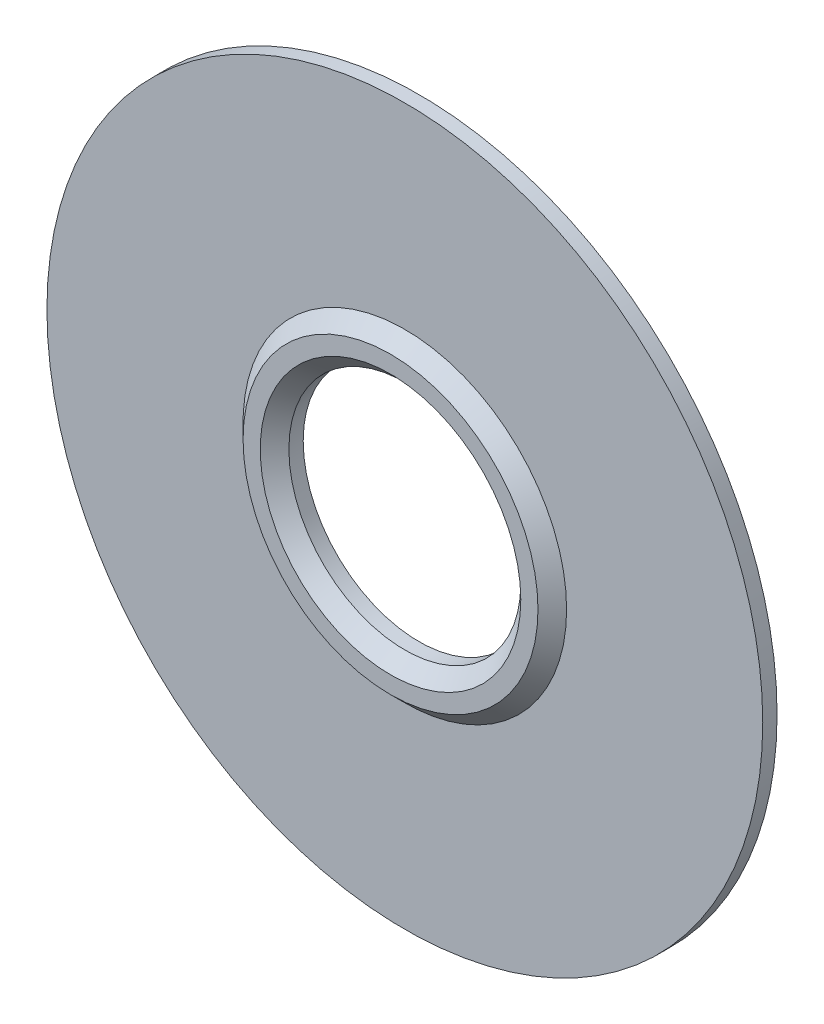
ISO-10303-21;
HEADER;
FILE_DESCRIPTION(('STEP AP214'),'2;1');
FILE_NAME('part.step','',(''),(''),'','','');
FILE_SCHEMA(('AUTOMOTIVE_DESIGN { 1 0 10303 214 1 1 1 1 }'));
ENDSEC;
DATA;
#1=APPLICATION_CONTEXT('core data for automotive mechanical design processes');
#2=APPLICATION_PROTOCOL_DEFINITION('international standard','automotive_design',2000,#1);
#3=PRODUCT_CONTEXT('',#1,'mechanical');
#4=PRODUCT('Part','Part','',(#3));
#5=PRODUCT_RELATED_PRODUCT_CATEGORY('part','',(#4));
#6=PRODUCT_DEFINITION_FORMATION('','',#4);
#7=PRODUCT_DEFINITION_CONTEXT('part definition',#1,'design');
#8=PRODUCT_DEFINITION('design','',#6,#7);
#9=PRODUCT_DEFINITION_SHAPE('','',#8);
#10=(LENGTH_UNIT() NAMED_UNIT(*) SI_UNIT(.MILLI.,.METRE.));
#11=(NAMED_UNIT(*) PLANE_ANGLE_UNIT() SI_UNIT($,.RADIAN.));
#12=(NAMED_UNIT(*) SI_UNIT($,.STERADIAN.) SOLID_ANGLE_UNIT());
#13=UNCERTAINTY_MEASURE_WITH_UNIT(LENGTH_MEASURE(1.E-05),#10,'distance_accuracy_value','');
#14=(GEOMETRIC_REPRESENTATION_CONTEXT(3) GLOBAL_UNCERTAINTY_ASSIGNED_CONTEXT((#13)) GLOBAL_UNIT_ASSIGNED_CONTEXT((#10,
#11,#12)) REPRESENTATION_CONTEXT('',''));
#15=CARTESIAN_POINT('',(0.,0.,0.));
#16=DIRECTION('',(0.,0.,1.));
#17=DIRECTION('',(1.,0.,0.));
#18=AXIS2_PLACEMENT_3D('',#15,#16,#17);
#19=CARTESIAN_POINT('',(0.,0.,0.));
#20=DIRECTION('',(0.,0.,1.));
#21=DIRECTION('',(1.,0.,0.));
#22=AXIS2_PLACEMENT_3D('',#19,#20,#21);
#23=PLANE('',#22);
#24=CARTESIAN_POINT('',(-0.0658460090951503,4.97857142857144,0.));
#25=DIRECTION('',(0.,0.,1.));
#26=DIRECTION('',(1.,0.,0.));
#27=AXIS2_PLACEMENT_3D('',#24,#25,#26);
#28=CIRCLE('',#27,25.);
#29=CARTESIAN_POINT('',(24.9341539909049,4.97857142857144,0.));
#30=VERTEX_POINT('',#29);
#31=EDGE_CURVE('E39',#30,#30,#28,.T.);
#32=ORIENTED_EDGE('',*,*,#31,.T.);
#33=EDGE_LOOP('',(#32));
#34=FACE_BOUND('',#33,.T.);
#35=CARTESIAN_POINT('',(-0.0658460090951513,4.97857142857141,0.));
#36=DIRECTION('',(0.,0.,1.));
#37=DIRECTION('',(1.,0.,0.));
#38=AXIS2_PLACEMENT_3D('',#35,#36,#37);
#39=CIRCLE('',#38,11.3);
#40=CARTESIAN_POINT('',(11.2341539909049,4.97857142857141,0.));
#41=VERTEX_POINT('',#40);
#42=EDGE_CURVE('E52',#41,#41,#39,.T.);
#43=ORIENTED_EDGE('',*,*,#42,.F.);
#44=EDGE_LOOP('',(#43));
#45=FACE_BOUND('',#44,.T.);
#46=ADVANCED_FACE('F35',(#34,#45),#23,.T.);
#47=CARTESIAN_POINT('',(-0.0658460090951496,4.97857142857143,-1.));
#48=DIRECTION('',(0.,0.,1.));
#49=DIRECTION('',(1.,0.,0.));
#50=AXIS2_PLACEMENT_3D('',#47,#48,#49);
#51=CYLINDRICAL_SURFACE('',#50,8.1);
#52=CARTESIAN_POINT('',(-0.0658460090951496,4.97857142857143,-1.));
#53=DIRECTION('',(0.,0.,1.));
#54=DIRECTION('',(1.,0.,0.));
#55=AXIS2_PLACEMENT_3D('',#52,#53,#54);
#56=CIRCLE('',#55,8.1);
#57=CARTESIAN_POINT('',(8.03415399090485,4.97857142857143,-1.));
#58=VERTEX_POINT('',#57);
#59=EDGE_CURVE('E43',#58,#58,#56,.T.);
#60=ORIENTED_EDGE('',*,*,#59,.F.);
#61=EDGE_LOOP('',(#60));
#62=FACE_BOUND('',#61,.T.);
#63=CARTESIAN_POINT('',(-0.0658460090951593,4.97857142857142,0.));
#64=DIRECTION('',(0.,0.,1.));
#65=DIRECTION('',(1.,0.,0.));
#66=AXIS2_PLACEMENT_3D('',#63,#64,#65);
#67=CIRCLE('',#66,8.10000000000002);
#68=CARTESIAN_POINT('',(8.03415399090486,4.97857142857142,0.));
#69=VERTEX_POINT('',#68);
#70=EDGE_CURVE('E53',#69,#69,#67,.T.);
#71=ORIENTED_EDGE('',*,*,#70,.T.);
#72=EDGE_LOOP('',(#71));
#73=FACE_BOUND('',#72,.T.);
#74=ADVANCED_FACE('F37',(#62,#73),#51,.F.);
#75=CARTESIAN_POINT('',(-0.0658460090951503,4.97857142857144,-1.));
#76=DIRECTION('',(0.,0.,1.));
#77=DIRECTION('',(1.,0.,0.));
#78=AXIS2_PLACEMENT_3D('',#75,#76,#77);
#79=CYLINDRICAL_SURFACE('',#78,25.);
#80=CARTESIAN_POINT('',(-0.0658460090951503,4.97857142857144,-1.));
#81=DIRECTION('',(0.,0.,1.));
#82=DIRECTION('',(1.,0.,0.));
#83=AXIS2_PLACEMENT_3D('',#80,#81,#82);
#84=CIRCLE('',#83,25.);
#85=CARTESIAN_POINT('',(24.9341539909049,4.97857142857144,-1.));
#86=VERTEX_POINT('',#85);
#87=EDGE_CURVE('E10',#86,#86,#84,.T.);
#88=ORIENTED_EDGE('',*,*,#87,.T.);
#89=EDGE_LOOP('',(#88));
#90=FACE_BOUND('',#89,.T.);
#91=ORIENTED_EDGE('',*,*,#31,.F.);
#92=EDGE_LOOP('',(#91));
#93=FACE_BOUND('',#92,.T.);
#94=ADVANCED_FACE('F81',(#90,#93),#79,.T.);
#95=CARTESIAN_POINT('',(0.,0.,-1.));
#96=DIRECTION('',(0.,0.,1.));
#97=DIRECTION('',(1.,0.,0.));
#98=AXIS2_PLACEMENT_3D('',#95,#96,#97);
#99=PLANE('',#98);
#100=ORIENTED_EDGE('',*,*,#59,.T.);
#101=EDGE_LOOP('',(#100));
#102=FACE_BOUND('',#101,.T.);
#103=ORIENTED_EDGE('',*,*,#87,.F.);
#104=EDGE_LOOP('',(#103));
#105=FACE_BOUND('',#104,.T.);
#106=ADVANCED_FACE('F85',(#102,#105),#99,.F.);
#107=CARTESIAN_POINT('',(-0.0658460090951513,4.97857142857141,1.));
#108=DIRECTION('',(0.,0.,1.));
#109=DIRECTION('',(1.,0.,0.));
#110=AXIS2_PLACEMENT_3D('',#107,#108,#109);
#111=PLANE('',#110);
#112=CARTESIAN_POINT('',(-0.0658460090951513,4.97857142857141,1.));
#113=DIRECTION('',(0.,0.,1.));
#114=DIRECTION('',(1.,0.,0.));
#115=AXIS2_PLACEMENT_3D('',#112,#113,#114);
#116=CIRCLE('',#115,10.3);
#117=CARTESIAN_POINT('',(10.2341539909048,4.97857142857141,1.));
#118=VERTEX_POINT('',#117);
#119=EDGE_CURVE('E54',#118,#118,#116,.T.);
#120=ORIENTED_EDGE('',*,*,#119,.T.);
#121=EDGE_LOOP('',(#120));
#122=FACE_BOUND('',#121,.T.);
#123=CARTESIAN_POINT('',(-0.0658460090951593,4.97857142857142,1.));
#124=DIRECTION('',(0.,0.,1.));
#125=DIRECTION('',(1.,0.,0.));
#126=AXIS2_PLACEMENT_3D('',#123,#124,#125);
#127=CIRCLE('',#126,9.10000000000002);
#128=CARTESIAN_POINT('',(9.03415399090486,4.97857142857142,1.));
#129=VERTEX_POINT('',#128);
#130=EDGE_CURVE('E49',#129,#129,#127,.T.);
#131=ORIENTED_EDGE('',*,*,#130,.F.);
#132=EDGE_LOOP('',(#131));
#133=FACE_BOUND('',#132,.T.);
#134=ADVANCED_FACE('F71',(#122,#133),#111,.T.);
#135=CARTESIAN_POINT('',(-0.0658460090951513,4.97857142857141,0.));
#136=DIRECTION('',(0.,0.,-1.));
#137=DIRECTION('',(1.,0.,0.));
#138=AXIS2_PLACEMENT_3D('',#135,#136,#137);
#139=CONICAL_SURFACE('',#138,11.3,0.78539816339745);
#140=ORIENTED_EDGE('',*,*,#119,.F.);
#141=EDGE_LOOP('',(#140));
#142=FACE_BOUND('',#141,.T.);
#143=ORIENTED_EDGE('',*,*,#42,.T.);
#144=EDGE_LOOP('',(#143));
#145=FACE_BOUND('',#144,.T.);
#146=ADVANCED_FACE('F65',(#142,#145),#139,.T.);
#147=CARTESIAN_POINT('',(-0.0658460090951593,4.97857142857142,0.));
#148=DIRECTION('',(0.,0.,1.));
#149=DIRECTION('',(1.,0.,0.));
#150=AXIS2_PLACEMENT_3D('',#147,#148,#149);
#151=CONICAL_SURFACE('',#150,8.10000000000002,0.78539816339745);
#152=ORIENTED_EDGE('',*,*,#130,.T.);
#153=EDGE_LOOP('',(#152));
#154=FACE_BOUND('',#153,.T.);
#155=ORIENTED_EDGE('',*,*,#70,.F.);
#156=EDGE_LOOP('',(#155));
#157=FACE_BOUND('',#156,.T.);
#158=ADVANCED_FACE('F63',(#154,#157),#151,.F.);
#159=CLOSED_SHELL('',(#46,#74,#94,#106,#134,#146,#158));
#160=MANIFOLD_SOLID_BREP('B2',#159);
#161=ADVANCED_BREP_SHAPE_REPRESENTATION('',(#18,#160),#14);
#162=SHAPE_DEFINITION_REPRESENTATION(#9,#161);
ENDSEC;
END-ISO-10303-21;
